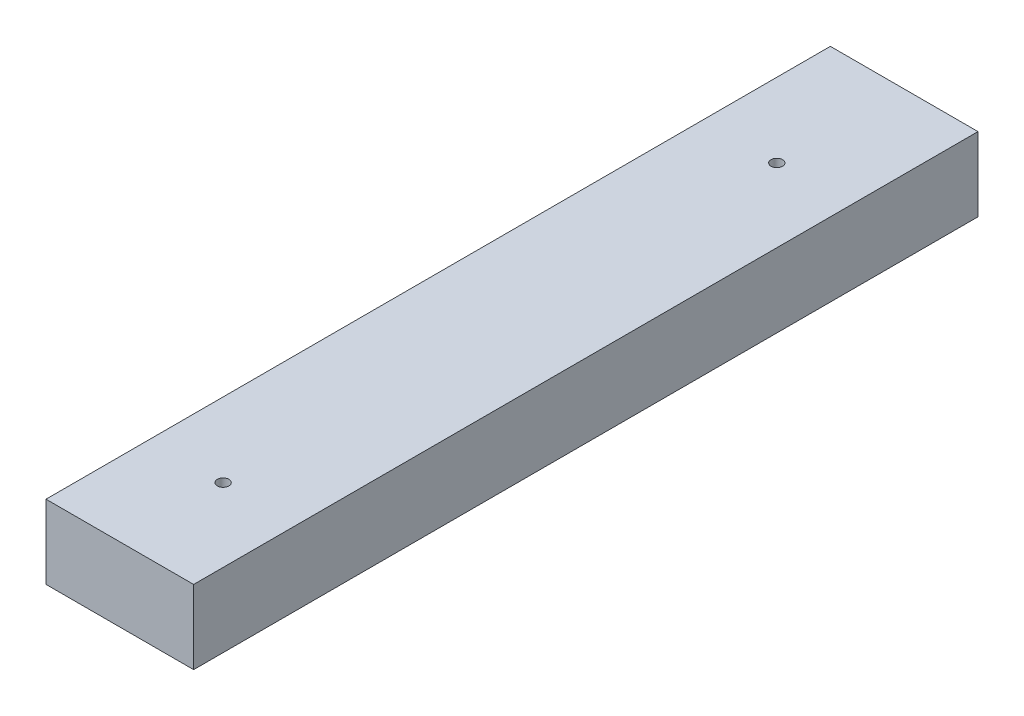
ISO-10303-21;
HEADER;
FILE_DESCRIPTION(('STEP AP214'),'2;1');
FILE_NAME('part.step','',(''),(''),'','','');
FILE_SCHEMA(('AUTOMOTIVE_DESIGN { 1 0 10303 214 1 1 1 1 }'));
ENDSEC;
DATA;
#1=APPLICATION_CONTEXT('core data for automotive mechanical design processes');
#2=APPLICATION_PROTOCOL_DEFINITION('international standard','automotive_design',2000,#1);
#3=PRODUCT_CONTEXT('',#1,'mechanical');
#4=PRODUCT('Part','Part','',(#3));
#5=PRODUCT_RELATED_PRODUCT_CATEGORY('part','',(#4));
#6=PRODUCT_DEFINITION_FORMATION('','',#4);
#7=PRODUCT_DEFINITION_CONTEXT('part definition',#1,'design');
#8=PRODUCT_DEFINITION('design','',#6,#7);
#9=PRODUCT_DEFINITION_SHAPE('','',#8);
#10=(LENGTH_UNIT() NAMED_UNIT(*) SI_UNIT(.MILLI.,.METRE.));
#11=(NAMED_UNIT(*) PLANE_ANGLE_UNIT() SI_UNIT($,.RADIAN.));
#12=(NAMED_UNIT(*) SI_UNIT($,.STERADIAN.) SOLID_ANGLE_UNIT());
#13=UNCERTAINTY_MEASURE_WITH_UNIT(LENGTH_MEASURE(1.E-05),#10,'distance_accuracy_value','');
#14=(GEOMETRIC_REPRESENTATION_CONTEXT(3) GLOBAL_UNCERTAINTY_ASSIGNED_CONTEXT((#13)) GLOBAL_UNIT_ASSIGNED_CONTEXT((#10,
#11,#12)) REPRESENTATION_CONTEXT('',''));
#15=CARTESIAN_POINT('',(0.,0.,0.));
#16=DIRECTION('',(0.,0.,1.));
#17=DIRECTION('',(1.,0.,0.));
#18=AXIS2_PLACEMENT_3D('',#15,#16,#17);
#19=CARTESIAN_POINT('',(0.,0.,539.75));
#20=DIRECTION('',(-1.,0.,0.));
#21=DIRECTION('',(0.,0.,1.));
#22=AXIS2_PLACEMENT_3D('',#19,#20,#21);
#23=PLANE('',#22);
#24=DIRECTION('',(0.,1.,0.));
#25=VECTOR('',#24,1.);
#26=CARTESIAN_POINT('',(0.,0.,0.));
#27=LINE('',#26,#25);
#28=CARTESIAN_POINT('',(0.,0.,0.));
#29=VERTEX_POINT('',#28);
#30=CARTESIAN_POINT('',(0.,50.8,0.));
#31=VERTEX_POINT('',#30);
#32=EDGE_CURVE('E96',#29,#31,#27,.T.);
#33=ORIENTED_EDGE('',*,*,#32,.T.);
#34=DIRECTION('',(0.,0.,-1.));
#35=VECTOR('',#34,1.);
#36=CARTESIAN_POINT('',(0.,50.8,539.75));
#37=LINE('',#36,#35);
#38=CARTESIAN_POINT('',(0.,50.8,539.75));
#39=VERTEX_POINT('',#38);
#40=EDGE_CURVE('E11',#39,#31,#37,.T.);
#41=ORIENTED_EDGE('',*,*,#40,.F.);
#42=DIRECTION('',(0.,1.,0.));
#43=VECTOR('',#42,1.);
#44=CARTESIAN_POINT('',(0.,0.,539.75));
#45=LINE('',#44,#43);
#46=CARTESIAN_POINT('',(0.,0.,539.75));
#47=VERTEX_POINT('',#46);
#48=EDGE_CURVE('E84',#47,#39,#45,.T.);
#49=ORIENTED_EDGE('',*,*,#48,.F.);
#50=DIRECTION('',(0.,0.,-1.));
#51=VECTOR('',#50,1.);
#52=CARTESIAN_POINT('',(0.,0.,539.75));
#53=LINE('',#52,#51);
#54=EDGE_CURVE('E92',#47,#29,#53,.T.);
#55=ORIENTED_EDGE('',*,*,#54,.T.);
#56=EDGE_LOOP('',(#33,#41,#49,#55));
#57=FACE_BOUND('',#56,.T.);
#58=ADVANCED_FACE('F33',(#57),#23,.F.);
#59=CARTESIAN_POINT('',(0.,50.8,539.75));
#60=DIRECTION('',(0.,-1.,0.));
#61=DIRECTION('',(1.,0.,0.));
#62=AXIS2_PLACEMENT_3D('',#59,#60,#61);
#63=PLANE('',#62);
#64=CARTESIAN_POINT('',(-50.5322790317964,50.8,468.935910633016));
#65=DIRECTION('',(0.,1.,0.));
#66=DIRECTION('',(-1.,0.,0.));
#67=AXIS2_PLACEMENT_3D('',#64,#65,#66);
#68=CIRCLE('',#67,3.96875);
#69=CARTESIAN_POINT('',(-54.5010290317964,50.8,468.935910633016));
#70=VERTEX_POINT('',#69);
#71=EDGE_CURVE('E116',#70,#70,#68,.T.);
#72=ORIENTED_EDGE('',*,*,#71,.F.);
#73=EDGE_LOOP('',(#72));
#74=FACE_BOUND('',#73,.T.);
#75=CARTESIAN_POINT('',(-50.5322790317964,50.8,87.9359106330156));
#76=DIRECTION('',(0.,1.,0.));
#77=DIRECTION('',(-1.,0.,0.));
#78=AXIS2_PLACEMENT_3D('',#75,#76,#77);
#79=CIRCLE('',#78,3.96875);
#80=CARTESIAN_POINT('',(-54.5010290317963,50.8,87.9359106330156));
#81=VERTEX_POINT('',#80);
#82=EDGE_CURVE('E110',#81,#81,#79,.T.);
#83=ORIENTED_EDGE('',*,*,#82,.F.);
#84=EDGE_LOOP('',(#83));
#85=FACE_BOUND('',#84,.T.);
#86=DIRECTION('',(-1.,0.,0.));
#87=VECTOR('',#86,1.);
#88=CARTESIAN_POINT('',(0.,50.8,0.));
#89=LINE('',#88,#87);
#90=CARTESIAN_POINT('',(-101.6,50.8,0.));
#91=VERTEX_POINT('',#90);
#92=EDGE_CURVE('E88',#31,#91,#89,.T.);
#93=ORIENTED_EDGE('',*,*,#92,.T.);
#94=DIRECTION('',(0.,0.,-1.));
#95=VECTOR('',#94,1.);
#96=CARTESIAN_POINT('',(-101.6,50.8,539.75));
#97=LINE('',#96,#95);
#98=CARTESIAN_POINT('',(-101.6,50.8,539.75));
#99=VERTEX_POINT('',#98);
#100=EDGE_CURVE('E41',#99,#91,#97,.T.);
#101=ORIENTED_EDGE('',*,*,#100,.F.);
#102=DIRECTION('',(-1.,0.,0.));
#103=VECTOR('',#102,1.);
#104=CARTESIAN_POINT('',(0.,50.8,539.75));
#105=LINE('',#104,#103);
#106=EDGE_CURVE('E79',#39,#99,#105,.T.);
#107=ORIENTED_EDGE('',*,*,#106,.F.);
#108=ORIENTED_EDGE('',*,*,#40,.T.);
#109=EDGE_LOOP('',(#93,#101,#107,#108));
#110=FACE_BOUND('',#109,.T.);
#111=ADVANCED_FACE('F87',(#74,#85,#110),#63,.F.);
#112=CARTESIAN_POINT('',(-101.6,0.,539.75));
#113=DIRECTION('',(1.,0.,0.));
#114=DIRECTION('',(0.,0.,-1.));
#115=AXIS2_PLACEMENT_3D('',#112,#113,#114);
#116=PLANE('',#115);
#117=DIRECTION('',(0.,-1.,0.));
#118=VECTOR('',#117,1.);
#119=CARTESIAN_POINT('',(-101.6,0.,0.));
#120=LINE('',#119,#118);
#121=CARTESIAN_POINT('',(-101.6,0.,0.));
#122=VERTEX_POINT('',#121);
#123=EDGE_CURVE('E66',#91,#122,#120,.T.);
#124=ORIENTED_EDGE('',*,*,#123,.T.);
#125=DIRECTION('',(0.,0.,-1.));
#126=VECTOR('',#125,1.);
#127=CARTESIAN_POINT('',(-101.6,0.,539.75));
#128=LINE('',#127,#126);
#129=CARTESIAN_POINT('',(-101.6,0.,539.75));
#130=VERTEX_POINT('',#129);
#131=EDGE_CURVE('E89',#130,#122,#128,.T.);
#132=ORIENTED_EDGE('',*,*,#131,.F.);
#133=DIRECTION('',(0.,-1.,0.));
#134=VECTOR('',#133,1.);
#135=CARTESIAN_POINT('',(-101.6,0.,539.75));
#136=LINE('',#135,#134);
#137=EDGE_CURVE('E82',#99,#130,#136,.T.);
#138=ORIENTED_EDGE('',*,*,#137,.F.);
#139=ORIENTED_EDGE('',*,*,#100,.T.);
#140=EDGE_LOOP('',(#124,#132,#138,#139));
#141=FACE_BOUND('',#140,.T.);
#142=ADVANCED_FACE('F90',(#141),#116,.F.);
#143=CARTESIAN_POINT('',(0.,0.,539.75));
#144=DIRECTION('',(0.,1.,0.));
#145=DIRECTION('',(-1.,0.,0.));
#146=AXIS2_PLACEMENT_3D('',#143,#144,#145);
#147=PLANE('',#146);
#148=CARTESIAN_POINT('',(-50.5322790317963,0.,468.935910633016));
#149=DIRECTION('',(0.,1.,0.));
#150=DIRECTION('',(-1.,0.,0.));
#151=AXIS2_PLACEMENT_3D('',#148,#149,#150);
#152=CIRCLE('',#151,3.96875);
#153=CARTESIAN_POINT('',(-54.5010290317964,0.,468.935910633016));
#154=VERTEX_POINT('',#153);
#155=EDGE_CURVE('E113',#154,#154,#152,.T.);
#156=ORIENTED_EDGE('',*,*,#155,.T.);
#157=EDGE_LOOP('',(#156));
#158=FACE_BOUND('',#157,.T.);
#159=CARTESIAN_POINT('',(-50.5322790317963,0.,87.9359106330156));
#160=DIRECTION('',(0.,1.,0.));
#161=DIRECTION('',(-1.,0.,0.));
#162=AXIS2_PLACEMENT_3D('',#159,#160,#161);
#163=CIRCLE('',#162,3.96875);
#164=CARTESIAN_POINT('',(-54.5010290317963,0.,87.9359106330156));
#165=VERTEX_POINT('',#164);
#166=EDGE_CURVE('E99',#165,#165,#163,.T.);
#167=ORIENTED_EDGE('',*,*,#166,.T.);
#168=EDGE_LOOP('',(#167));
#169=FACE_BOUND('',#168,.T.);
#170=DIRECTION('',(1.,0.,0.));
#171=VECTOR('',#170,1.);
#172=CARTESIAN_POINT('',(0.,0.,0.));
#173=LINE('',#172,#171);
#174=EDGE_CURVE('E72',#122,#29,#173,.T.);
#175=ORIENTED_EDGE('',*,*,#174,.T.);
#176=ORIENTED_EDGE('',*,*,#54,.F.);
#177=DIRECTION('',(1.,0.,0.));
#178=VECTOR('',#177,1.);
#179=CARTESIAN_POINT('',(0.,0.,539.75));
#180=LINE('',#179,#178);
#181=EDGE_CURVE('E49',#130,#47,#180,.T.);
#182=ORIENTED_EDGE('',*,*,#181,.F.);
#183=ORIENTED_EDGE('',*,*,#131,.T.);
#184=EDGE_LOOP('',(#175,#176,#182,#183));
#185=FACE_BOUND('',#184,.T.);
#186=ADVANCED_FACE('F104',(#158,#169,#185),#147,.F.);
#187=CARTESIAN_POINT('',(0.,0.,539.75));
#188=DIRECTION('',(0.,0.,1.));
#189=DIRECTION('',(1.,0.,0.));
#190=AXIS2_PLACEMENT_3D('',#187,#188,#189);
#191=PLANE('',#190);
#192=ORIENTED_EDGE('',*,*,#48,.T.);
#193=ORIENTED_EDGE('',*,*,#106,.T.);
#194=ORIENTED_EDGE('',*,*,#137,.T.);
#195=ORIENTED_EDGE('',*,*,#181,.T.);
#196=EDGE_LOOP('',(#192,#193,#194,#195));
#197=FACE_BOUND('',#196,.T.);
#198=ADVANCED_FACE('F80',(#197),#191,.T.);
#199=CARTESIAN_POINT('',(0.,0.,0.));
#200=DIRECTION('',(0.,0.,1.));
#201=DIRECTION('',(1.,0.,0.));
#202=AXIS2_PLACEMENT_3D('',#199,#200,#201);
#203=PLANE('',#202);
#204=ORIENTED_EDGE('',*,*,#32,.F.);
#205=ORIENTED_EDGE('',*,*,#174,.F.);
#206=ORIENTED_EDGE('',*,*,#123,.F.);
#207=ORIENTED_EDGE('',*,*,#92,.F.);
#208=EDGE_LOOP('',(#204,#205,#206,#207));
#209=FACE_BOUND('',#208,.T.);
#210=ADVANCED_FACE('F107',(#209),#203,.F.);
#211=CARTESIAN_POINT('',(-50.5322790317963,0.,87.9359106330156));
#212=DIRECTION('',(0.,1.,0.));
#213=DIRECTION('',(-1.,0.,0.));
#214=AXIS2_PLACEMENT_3D('',#211,#212,#213);
#215=CYLINDRICAL_SURFACE('',#214,3.96875);
#216=ORIENTED_EDGE('',*,*,#166,.F.);
#217=EDGE_LOOP('',(#216));
#218=FACE_BOUND('',#217,.T.);
#219=ORIENTED_EDGE('',*,*,#82,.T.);
#220=EDGE_LOOP('',(#219));
#221=FACE_BOUND('',#220,.T.);
#222=ADVANCED_FACE('F127',(#218,#221),#215,.F.);
#223=CARTESIAN_POINT('',(-50.5322790317963,0.,468.935910633016));
#224=DIRECTION('',(0.,1.,0.));
#225=DIRECTION('',(-1.,0.,0.));
#226=AXIS2_PLACEMENT_3D('',#223,#224,#225);
#227=CYLINDRICAL_SURFACE('',#226,3.96875);
#228=ORIENTED_EDGE('',*,*,#155,.F.);
#229=EDGE_LOOP('',(#228));
#230=FACE_BOUND('',#229,.T.);
#231=ORIENTED_EDGE('',*,*,#71,.T.);
#232=EDGE_LOOP('',(#231));
#233=FACE_BOUND('',#232,.T.);
#234=ADVANCED_FACE('F124',(#230,#233),#227,.F.);
#235=CLOSED_SHELL('',(#58,#111,#142,#186,#198,#210,#222,#234));
#236=MANIFOLD_SOLID_BREP('B2',#235);
#237=ADVANCED_BREP_SHAPE_REPRESENTATION('',(#18,#236),#14);
#238=SHAPE_DEFINITION_REPRESENTATION(#9,#237);
ENDSEC;
END-ISO-10303-21;
